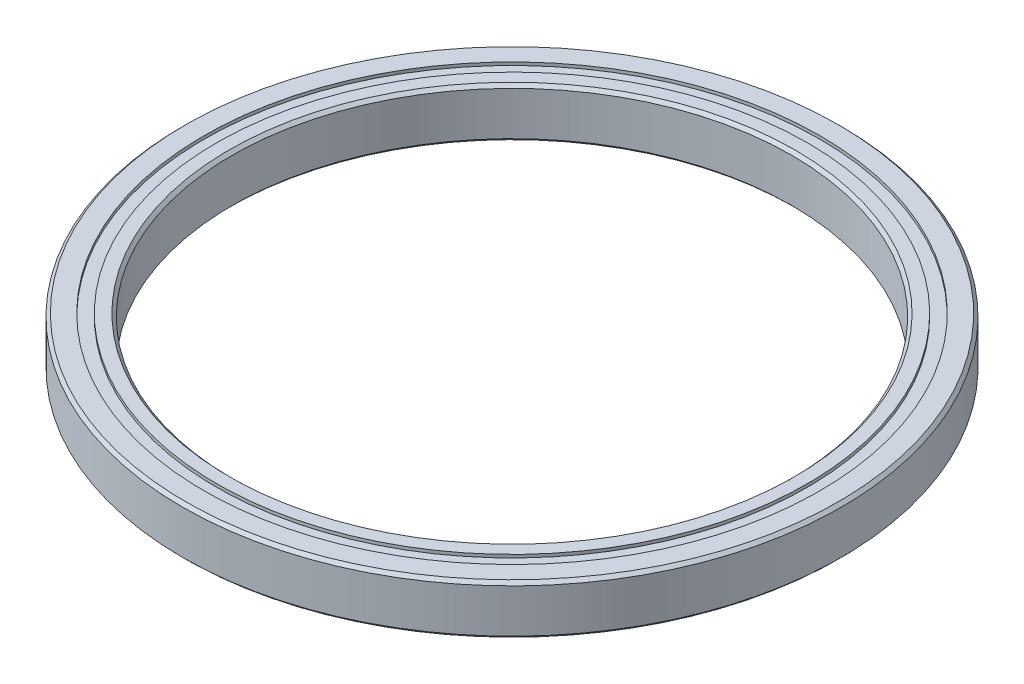
ISO-10303-21;
HEADER;
FILE_DESCRIPTION(('STEP AP214'),'2;1');
FILE_NAME('part.step','',(''),(''),'','','');
FILE_SCHEMA(('AUTOMOTIVE_DESIGN { 1 0 10303 214 1 1 1 1 }'));
ENDSEC;
DATA;
#1=APPLICATION_CONTEXT('core data for automotive mechanical design processes');
#2=APPLICATION_PROTOCOL_DEFINITION('international standard','automotive_design',2000,#1);
#3=PRODUCT_CONTEXT('',#1,'mechanical');
#4=PRODUCT('Part','Part','',(#3));
#5=PRODUCT_RELATED_PRODUCT_CATEGORY('part','',(#4));
#6=PRODUCT_DEFINITION_FORMATION('','',#4);
#7=PRODUCT_DEFINITION_CONTEXT('part definition',#1,'design');
#8=PRODUCT_DEFINITION('design','',#6,#7);
#9=PRODUCT_DEFINITION_SHAPE('','',#8);
#10=(LENGTH_UNIT() NAMED_UNIT(*) SI_UNIT(.MILLI.,.METRE.));
#11=(NAMED_UNIT(*) PLANE_ANGLE_UNIT() SI_UNIT($,.RADIAN.));
#12=(NAMED_UNIT(*) SI_UNIT($,.STERADIAN.) SOLID_ANGLE_UNIT());
#13=UNCERTAINTY_MEASURE_WITH_UNIT(LENGTH_MEASURE(1.E-05),#10,'distance_accuracy_value','');
#14=(GEOMETRIC_REPRESENTATION_CONTEXT(3) GLOBAL_UNCERTAINTY_ASSIGNED_CONTEXT((#13)) GLOBAL_UNIT_ASSIGNED_CONTEXT((#10,
#11,#12)) REPRESENTATION_CONTEXT('',''));
#15=CARTESIAN_POINT('',(0.,0.,0.));
#16=DIRECTION('',(0.,0.,1.));
#17=DIRECTION('',(1.,0.,0.));
#18=AXIS2_PLACEMENT_3D('',#15,#16,#17);
#19=CARTESIAN_POINT('',(0.,0.,0.));
#20=DIRECTION('',(0.,-1.,0.));
#21=DIRECTION('',(0.,0.,-1.));
#22=AXIS2_PLACEMENT_3D('',#19,#20,#21);
#23=CYLINDRICAL_SURFACE('',#22,49.5);
#24=CARTESIAN_POINT('',(0.,7.99999999999999,0.));
#25=DIRECTION('',(0.,-1.,0.));
#26=DIRECTION('',(0.,0.,-1.));
#27=AXIS2_PLACEMENT_3D('',#24,#25,#26);
#28=CIRCLE('',#27,49.5);
#29=CARTESIAN_POINT('',(0.,7.99999999999999,-49.5));
#30=VERTEX_POINT('',#29);
#31=EDGE_CURVE('E10',#30,#30,#28,.T.);
#32=ORIENTED_EDGE('',*,*,#31,.F.);
#33=EDGE_LOOP('',(#32));
#34=FACE_BOUND('',#33,.T.);
#35=CARTESIAN_POINT('',(0.,7.5,0.));
#36=DIRECTION('',(0.,-1.,0.));
#37=DIRECTION('',(0.,0.,-1.));
#38=AXIS2_PLACEMENT_3D('',#35,#36,#37);
#39=CIRCLE('',#38,49.5);
#40=CARTESIAN_POINT('',(0.,7.5,-49.5));
#41=VERTEX_POINT('',#40);
#42=EDGE_CURVE('E84',#41,#41,#39,.T.);
#43=ORIENTED_EDGE('',*,*,#42,.T.);
#44=EDGE_LOOP('',(#43));
#45=FACE_BOUND('',#44,.T.);
#46=ADVANCED_FACE('F32',(#34,#45),#23,.F.);
#47=CARTESIAN_POINT('',(-52.5,8.,0.));
#48=DIRECTION('',(0.,-1.,0.));
#49=DIRECTION('',(0.,0.,-1.));
#50=AXIS2_PLACEMENT_3D('',#47,#48,#49);
#51=PLANE('',#50);
#52=CARTESIAN_POINT('',(0.,8.,0.));
#53=DIRECTION('',(0.,-1.,0.));
#54=DIRECTION('',(0.,0.,-1.));
#55=AXIS2_PLACEMENT_3D('',#52,#53,#54);
#56=CIRCLE('',#55,52.5);
#57=CARTESIAN_POINT('',(0.,8.,-52.5));
#58=VERTEX_POINT('',#57);
#59=EDGE_CURVE('E38',#58,#58,#56,.T.);
#60=ORIENTED_EDGE('',*,*,#59,.F.);
#61=EDGE_LOOP('',(#60));
#62=FACE_BOUND('',#61,.T.);
#63=ORIENTED_EDGE('',*,*,#31,.T.);
#64=EDGE_LOOP('',(#63));
#65=FACE_BOUND('',#64,.T.);
#66=ADVANCED_FACE('F169',(#62,#65),#51,.F.);
#67=CARTESIAN_POINT('',(0.,8.,0.));
#68=DIRECTION('',(0.,-1.,0.));
#69=DIRECTION('',(0.,0.,-1.));
#70=AXIS2_PLACEMENT_3D('',#67,#68,#69);
#71=CONICAL_SURFACE('',#70,52.5,0.785398163397448);
#72=CARTESIAN_POINT('',(0.,7.5,0.));
#73=DIRECTION('',(0.,-1.,0.));
#74=DIRECTION('',(0.,0.,-1.));
#75=AXIS2_PLACEMENT_3D('',#72,#73,#74);
#76=CIRCLE('',#75,53.);
#77=CARTESIAN_POINT('',(0.,7.5,-53.));
#78=VERTEX_POINT('',#77);
#79=EDGE_CURVE('E42',#78,#78,#76,.T.);
#80=ORIENTED_EDGE('',*,*,#79,.F.);
#81=EDGE_LOOP('',(#80));
#82=FACE_BOUND('',#81,.T.);
#83=ORIENTED_EDGE('',*,*,#59,.T.);
#84=EDGE_LOOP('',(#83));
#85=FACE_BOUND('',#84,.T.);
#86=ADVANCED_FACE('F164',(#82,#85),#71,.T.);
#87=CARTESIAN_POINT('',(0.,0.,0.));
#88=DIRECTION('',(0.,-1.,0.));
#89=DIRECTION('',(0.,0.,-1.));
#90=AXIS2_PLACEMENT_3D('',#87,#88,#89);
#91=CYLINDRICAL_SURFACE('',#90,53.);
#92=CARTESIAN_POINT('',(0.,0.499999999999999,0.));
#93=DIRECTION('',(0.,-1.,0.));
#94=DIRECTION('',(0.,0.,-1.));
#95=AXIS2_PLACEMENT_3D('',#92,#93,#94);
#96=CIRCLE('',#95,53.);
#97=CARTESIAN_POINT('',(0.,0.499999999999999,-53.));
#98=VERTEX_POINT('',#97);
#99=EDGE_CURVE('E46',#98,#98,#96,.T.);
#100=ORIENTED_EDGE('',*,*,#99,.F.);
#101=EDGE_LOOP('',(#100));
#102=FACE_BOUND('',#101,.T.);
#103=ORIENTED_EDGE('',*,*,#79,.T.);
#104=EDGE_LOOP('',(#103));
#105=FACE_BOUND('',#104,.T.);
#106=ADVANCED_FACE('F158',(#102,#105),#91,.T.);
#107=CARTESIAN_POINT('',(0.,0.499999999999999,0.));
#108=DIRECTION('',(0.,1.,0.));
#109=DIRECTION('',(0.,0.,1.));
#110=AXIS2_PLACEMENT_3D('',#107,#108,#109);
#111=CONICAL_SURFACE('',#110,53.,0.785398163397448);
#112=CARTESIAN_POINT('',(0.,0.,0.));
#113=DIRECTION('',(0.,-1.,0.));
#114=DIRECTION('',(0.,0.,-1.));
#115=AXIS2_PLACEMENT_3D('',#112,#113,#114);
#116=CIRCLE('',#115,52.5);
#117=CARTESIAN_POINT('',(0.,0.,-52.5));
#118=VERTEX_POINT('',#117);
#119=EDGE_CURVE('E51',#118,#118,#116,.T.);
#120=ORIENTED_EDGE('',*,*,#119,.F.);
#121=EDGE_LOOP('',(#120));
#122=FACE_BOUND('',#121,.T.);
#123=ORIENTED_EDGE('',*,*,#99,.T.);
#124=EDGE_LOOP('',(#123));
#125=FACE_BOUND('',#124,.T.);
#126=ADVANCED_FACE('F152',(#122,#125),#111,.T.);
#127=CARTESIAN_POINT('',(-49.5,0.,0.));
#128=DIRECTION('',(0.,1.,0.));
#129=DIRECTION('',(0.,0.,1.));
#130=AXIS2_PLACEMENT_3D('',#127,#128,#129);
#131=PLANE('',#130);
#132=CARTESIAN_POINT('',(0.,0.,0.));
#133=DIRECTION('',(0.,-1.,0.));
#134=DIRECTION('',(0.,0.,-1.));
#135=AXIS2_PLACEMENT_3D('',#132,#133,#134);
#136=CIRCLE('',#135,49.5);
#137=CARTESIAN_POINT('',(0.,0.,-49.5));
#138=VERTEX_POINT('',#137);
#139=EDGE_CURVE('E54',#138,#138,#136,.T.);
#140=ORIENTED_EDGE('',*,*,#139,.F.);
#141=EDGE_LOOP('',(#140));
#142=FACE_BOUND('',#141,.T.);
#143=ORIENTED_EDGE('',*,*,#119,.T.);
#144=EDGE_LOOP('',(#143));
#145=FACE_BOUND('',#144,.T.);
#146=ADVANCED_FACE('F146',(#142,#145),#131,.F.);
#147=CARTESIAN_POINT('',(0.,0.,0.));
#148=DIRECTION('',(0.,-1.,0.));
#149=DIRECTION('',(0.,0.,-1.));
#150=AXIS2_PLACEMENT_3D('',#147,#148,#149);
#151=CYLINDRICAL_SURFACE('',#150,49.5);
#152=CARTESIAN_POINT('',(0.,0.499999999999994,0.));
#153=DIRECTION('',(0.,-1.,0.));
#154=DIRECTION('',(0.,0.,-1.));
#155=AXIS2_PLACEMENT_3D('',#152,#153,#154);
#156=CIRCLE('',#155,49.5);
#157=CARTESIAN_POINT('',(0.,0.499999999999994,-49.5));
#158=VERTEX_POINT('',#157);
#159=EDGE_CURVE('E57',#158,#158,#156,.T.);
#160=ORIENTED_EDGE('',*,*,#159,.F.);
#161=EDGE_LOOP('',(#160));
#162=FACE_BOUND('',#161,.T.);
#163=ORIENTED_EDGE('',*,*,#139,.T.);
#164=EDGE_LOOP('',(#163));
#165=FACE_BOUND('',#164,.T.);
#166=ADVANCED_FACE('F140',(#162,#165),#151,.F.);
#167=CARTESIAN_POINT('',(-49.5,0.499999999999993,0.));
#168=DIRECTION('',(0.,1.,0.));
#169=DIRECTION('',(0.,0.,1.));
#170=AXIS2_PLACEMENT_3D('',#167,#168,#169);
#171=PLANE('',#170);
#172=CARTESIAN_POINT('',(0.,0.499999999999993,0.));
#173=DIRECTION('',(0.,-1.,0.));
#174=DIRECTION('',(0.,0.,-1.));
#175=AXIS2_PLACEMENT_3D('',#172,#173,#174);
#176=CIRCLE('',#175,47.5);
#177=CARTESIAN_POINT('',(0.,0.499999999999993,-47.5));
#178=VERTEX_POINT('',#177);
#179=EDGE_CURVE('E60',#178,#178,#176,.T.);
#180=ORIENTED_EDGE('',*,*,#179,.F.);
#181=EDGE_LOOP('',(#180));
#182=FACE_BOUND('',#181,.T.);
#183=ORIENTED_EDGE('',*,*,#159,.T.);
#184=EDGE_LOOP('',(#183));
#185=FACE_BOUND('',#184,.T.);
#186=ADVANCED_FACE('F134',(#182,#185),#171,.F.);
#187=CARTESIAN_POINT('',(0.,0.,0.));
#188=DIRECTION('',(0.,-1.,0.));
#189=DIRECTION('',(0.,0.,-1.));
#190=AXIS2_PLACEMENT_3D('',#187,#188,#189);
#191=CYLINDRICAL_SURFACE('',#190,47.5);
#192=CARTESIAN_POINT('',(0.,0.,0.));
#193=DIRECTION('',(0.,-1.,0.));
#194=DIRECTION('',(0.,0.,-1.));
#195=AXIS2_PLACEMENT_3D('',#192,#193,#194);
#196=CIRCLE('',#195,47.5);
#197=CARTESIAN_POINT('',(0.,0.,-47.5));
#198=VERTEX_POINT('',#197);
#199=EDGE_CURVE('E63',#198,#198,#196,.T.);
#200=ORIENTED_EDGE('',*,*,#199,.F.);
#201=EDGE_LOOP('',(#200));
#202=FACE_BOUND('',#201,.T.);
#203=ORIENTED_EDGE('',*,*,#179,.T.);
#204=EDGE_LOOP('',(#203));
#205=FACE_BOUND('',#204,.T.);
#206=ADVANCED_FACE('F128',(#202,#205),#191,.T.);
#207=CARTESIAN_POINT('',(-45.5,0.,0.));
#208=DIRECTION('',(0.,1.,0.));
#209=DIRECTION('',(0.,0.,1.));
#210=AXIS2_PLACEMENT_3D('',#207,#208,#209);
#211=PLANE('',#210);
#212=CARTESIAN_POINT('',(0.,0.,0.));
#213=DIRECTION('',(0.,-1.,0.));
#214=DIRECTION('',(0.,0.,-1.));
#215=AXIS2_PLACEMENT_3D('',#212,#213,#214);
#216=CIRCLE('',#215,45.5);
#217=CARTESIAN_POINT('',(0.,0.,-45.5));
#218=VERTEX_POINT('',#217);
#219=EDGE_CURVE('E66',#218,#218,#216,.T.);
#220=ORIENTED_EDGE('',*,*,#219,.F.);
#221=EDGE_LOOP('',(#220));
#222=FACE_BOUND('',#221,.T.);
#223=ORIENTED_EDGE('',*,*,#199,.T.);
#224=EDGE_LOOP('',(#223));
#225=FACE_BOUND('',#224,.T.);
#226=ADVANCED_FACE('F122',(#222,#225),#211,.F.);
#227=CARTESIAN_POINT('',(0.,0.,0.));
#228=DIRECTION('',(0.,-1.,0.));
#229=DIRECTION('',(0.,0.,-1.));
#230=AXIS2_PLACEMENT_3D('',#227,#228,#229);
#231=CONICAL_SURFACE('',#230,45.5,0.785398163397447);
#232=CARTESIAN_POINT('',(0.,0.5,0.));
#233=DIRECTION('',(0.,-1.,0.));
#234=DIRECTION('',(0.,0.,-1.));
#235=AXIS2_PLACEMENT_3D('',#232,#233,#234);
#236=CIRCLE('',#235,45.);
#237=CARTESIAN_POINT('',(0.,0.5,-45.));
#238=VERTEX_POINT('',#237);
#239=EDGE_CURVE('E69',#238,#238,#236,.T.);
#240=ORIENTED_EDGE('',*,*,#239,.F.);
#241=EDGE_LOOP('',(#240));
#242=FACE_BOUND('',#241,.T.);
#243=ORIENTED_EDGE('',*,*,#219,.T.);
#244=EDGE_LOOP('',(#243));
#245=FACE_BOUND('',#244,.T.);
#246=ADVANCED_FACE('F116',(#242,#245),#231,.F.);
#247=CARTESIAN_POINT('',(0.,0.,0.));
#248=DIRECTION('',(0.,-1.,0.));
#249=DIRECTION('',(0.,0.,-1.));
#250=AXIS2_PLACEMENT_3D('',#247,#248,#249);
#251=CYLINDRICAL_SURFACE('',#250,45.);
#252=CARTESIAN_POINT('',(0.,7.5,0.));
#253=DIRECTION('',(0.,-1.,0.));
#254=DIRECTION('',(0.,0.,-1.));
#255=AXIS2_PLACEMENT_3D('',#252,#253,#254);
#256=CIRCLE('',#255,45.);
#257=CARTESIAN_POINT('',(0.,7.5,-45.));
#258=VERTEX_POINT('',#257);
#259=EDGE_CURVE('E72',#258,#258,#256,.T.);
#260=ORIENTED_EDGE('',*,*,#259,.F.);
#261=EDGE_LOOP('',(#260));
#262=FACE_BOUND('',#261,.T.);
#263=ORIENTED_EDGE('',*,*,#239,.T.);
#264=EDGE_LOOP('',(#263));
#265=FACE_BOUND('',#264,.T.);
#266=ADVANCED_FACE('F110',(#262,#265),#251,.F.);
#267=CARTESIAN_POINT('',(0.,7.5,0.));
#268=DIRECTION('',(0.,1.,0.));
#269=DIRECTION('',(0.,0.,1.));
#270=AXIS2_PLACEMENT_3D('',#267,#268,#269);
#271=CONICAL_SURFACE('',#270,45.,0.78539816339745);
#272=CARTESIAN_POINT('',(0.,8.,0.));
#273=DIRECTION('',(0.,-1.,0.));
#274=DIRECTION('',(0.,0.,-1.));
#275=AXIS2_PLACEMENT_3D('',#272,#273,#274);
#276=CIRCLE('',#275,45.5);
#277=CARTESIAN_POINT('',(0.,8.,-45.5));
#278=VERTEX_POINT('',#277);
#279=EDGE_CURVE('E75',#278,#278,#276,.T.);
#280=ORIENTED_EDGE('',*,*,#279,.F.);
#281=EDGE_LOOP('',(#280));
#282=FACE_BOUND('',#281,.T.);
#283=ORIENTED_EDGE('',*,*,#259,.T.);
#284=EDGE_LOOP('',(#283));
#285=FACE_BOUND('',#284,.T.);
#286=ADVANCED_FACE('F104',(#282,#285),#271,.F.);
#287=CARTESIAN_POINT('',(-47.5,8.,0.));
#288=DIRECTION('',(0.,-1.,0.));
#289=DIRECTION('',(0.,0.,-1.));
#290=AXIS2_PLACEMENT_3D('',#287,#288,#289);
#291=PLANE('',#290);
#292=CARTESIAN_POINT('',(0.,7.99999999999999,0.));
#293=DIRECTION('',(0.,-1.,0.));
#294=DIRECTION('',(0.,0.,-1.));
#295=AXIS2_PLACEMENT_3D('',#292,#293,#294);
#296=CIRCLE('',#295,47.5);
#297=CARTESIAN_POINT('',(0.,7.99999999999999,-47.5));
#298=VERTEX_POINT('',#297);
#299=EDGE_CURVE('E78',#298,#298,#296,.T.);
#300=ORIENTED_EDGE('',*,*,#299,.F.);
#301=EDGE_LOOP('',(#300));
#302=FACE_BOUND('',#301,.T.);
#303=ORIENTED_EDGE('',*,*,#279,.T.);
#304=EDGE_LOOP('',(#303));
#305=FACE_BOUND('',#304,.T.);
#306=ADVANCED_FACE('F98',(#302,#305),#291,.F.);
#307=CARTESIAN_POINT('',(0.,0.,0.));
#308=DIRECTION('',(0.,-1.,0.));
#309=DIRECTION('',(0.,0.,-1.));
#310=AXIS2_PLACEMENT_3D('',#307,#308,#309);
#311=CYLINDRICAL_SURFACE('',#310,47.5);
#312=CARTESIAN_POINT('',(0.,7.5,0.));
#313=DIRECTION('',(0.,-1.,0.));
#314=DIRECTION('',(0.,0.,-1.));
#315=AXIS2_PLACEMENT_3D('',#312,#313,#314);
#316=CIRCLE('',#315,47.5);
#317=CARTESIAN_POINT('',(0.,7.5,-47.5));
#318=VERTEX_POINT('',#317);
#319=EDGE_CURVE('E81',#318,#318,#316,.T.);
#320=ORIENTED_EDGE('',*,*,#319,.F.);
#321=EDGE_LOOP('',(#320));
#322=FACE_BOUND('',#321,.T.);
#323=ORIENTED_EDGE('',*,*,#299,.T.);
#324=EDGE_LOOP('',(#323));
#325=FACE_BOUND('',#324,.T.);
#326=ADVANCED_FACE('F92',(#322,#325),#311,.T.);
#327=CARTESIAN_POINT('',(-49.5,7.5,0.));
#328=DIRECTION('',(0.,-1.,0.));
#329=DIRECTION('',(0.,0.,-1.));
#330=AXIS2_PLACEMENT_3D('',#327,#328,#329);
#331=PLANE('',#330);
#332=ORIENTED_EDGE('',*,*,#42,.F.);
#333=EDGE_LOOP('',(#332));
#334=FACE_BOUND('',#333,.T.);
#335=ORIENTED_EDGE('',*,*,#319,.T.);
#336=EDGE_LOOP('',(#335));
#337=FACE_BOUND('',#336,.T.);
#338=ADVANCED_FACE('F89',(#334,#337),#331,.F.);
#339=CLOSED_SHELL('',(#46,#66,#86,#106,#126,#146,#166,#186,#206,#226,#246,#266,#286,#306,#326,#338));
#340=MANIFOLD_SOLID_BREP('B2',#339);
#341=ADVANCED_BREP_SHAPE_REPRESENTATION('',(#18,#340),#14);
#342=SHAPE_DEFINITION_REPRESENTATION(#9,#341);
ENDSEC;
END-ISO-10303-21;
